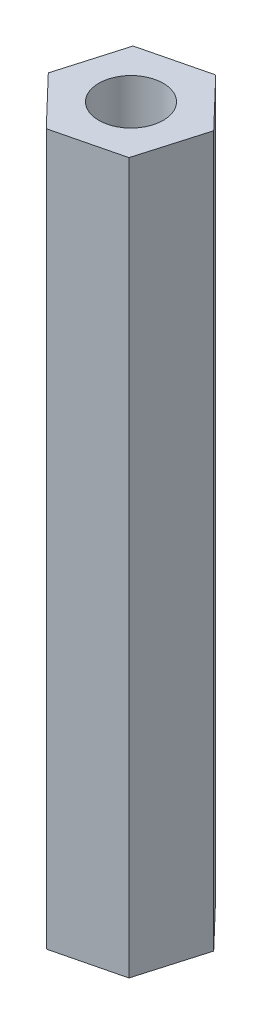
ISO-10303-21;
HEADER;
FILE_DESCRIPTION(('STEP AP214'),'2;1');
FILE_NAME('part.step','',(''),(''),'','','');
FILE_SCHEMA(('AUTOMOTIVE_DESIGN { 1 0 10303 214 1 1 1 1 }'));
ENDSEC;
DATA;
#1=APPLICATION_CONTEXT('core data for automotive mechanical design processes');
#2=APPLICATION_PROTOCOL_DEFINITION('international standard','automotive_design',2000,#1);
#3=PRODUCT_CONTEXT('',#1,'mechanical');
#4=PRODUCT('Part','Part','',(#3));
#5=PRODUCT_RELATED_PRODUCT_CATEGORY('part','',(#4));
#6=PRODUCT_DEFINITION_FORMATION('','',#4);
#7=PRODUCT_DEFINITION_CONTEXT('part definition',#1,'design');
#8=PRODUCT_DEFINITION('design','',#6,#7);
#9=PRODUCT_DEFINITION_SHAPE('','',#8);
#10=(LENGTH_UNIT() NAMED_UNIT(*) SI_UNIT(.MILLI.,.METRE.));
#11=(NAMED_UNIT(*) PLANE_ANGLE_UNIT() SI_UNIT($,.RADIAN.));
#12=(NAMED_UNIT(*) SI_UNIT($,.STERADIAN.) SOLID_ANGLE_UNIT());
#13=UNCERTAINTY_MEASURE_WITH_UNIT(LENGTH_MEASURE(1.E-05),#10,'distance_accuracy_value','');
#14=(GEOMETRIC_REPRESENTATION_CONTEXT(3) GLOBAL_UNCERTAINTY_ASSIGNED_CONTEXT((#13)) GLOBAL_UNIT_ASSIGNED_CONTEXT((#10,
#11,#12)) REPRESENTATION_CONTEXT('',''));
#15=CARTESIAN_POINT('',(0.,0.,0.));
#16=DIRECTION('',(0.,0.,1.));
#17=DIRECTION('',(1.,0.,0.));
#18=AXIS2_PLACEMENT_3D('',#15,#16,#17);
#19=CARTESIAN_POINT('',(-6.32811130994487,38.1,-2.46052037020981));
#20=DIRECTION('',(-0.238502387947703,0.,-0.971141910815944));
#21=DIRECTION('',(-0.971141910815944,0.,0.238502387947703));
#22=AXIS2_PLACEMENT_3D('',#19,#20,#21);
#23=PLANE('',#22);
#24=DIRECTION('',(0.971141910815944,0.,-0.238502387947703));
#25=VECTOR('',#24,1.);
#26=CARTESIAN_POINT('',(-6.32811130994487,0.,-2.46052037020981));
#27=LINE('',#26,#25);
#28=CARTESIAN_POINT('',(-6.32811130994487,0.,-2.46052037020981));
#29=VERTEX_POINT('',#28);
#30=CARTESIAN_POINT('',(-2.76773588288857,0.,-3.33491167377304));
#31=VERTEX_POINT('',#30);
#32=EDGE_CURVE('E121',#29,#31,#27,.T.);
#33=ORIENTED_EDGE('',*,*,#32,.T.);
#34=DIRECTION('',(0.,-1.,0.));
#35=VECTOR('',#34,1.);
#36=CARTESIAN_POINT('',(-2.76773588288857,38.1,-3.33491167377304));
#37=LINE('',#36,#35);
#38=CARTESIAN_POINT('',(-2.76773588288857,38.1,-3.33491167377304));
#39=VERTEX_POINT('',#38);
#40=EDGE_CURVE('E11',#39,#31,#37,.T.);
#41=ORIENTED_EDGE('',*,*,#40,.F.);
#42=DIRECTION('',(0.971141910815944,0.,-0.238502387947703));
#43=VECTOR('',#42,1.);
#44=CARTESIAN_POINT('',(-6.32811130994487,38.1,-2.46052037020981));
#45=LINE('',#44,#43);
#46=CARTESIAN_POINT('',(-6.32811130994487,38.1,-2.46052037020981));
#47=VERTEX_POINT('',#46);
#48=EDGE_CURVE('E132',#47,#39,#45,.T.);
#49=ORIENTED_EDGE('',*,*,#48,.F.);
#50=DIRECTION('',(0.,-1.,0.));
#51=VECTOR('',#50,1.);
#52=CARTESIAN_POINT('',(-6.32811130994487,38.1,-2.46052037020981));
#53=LINE('',#52,#51);
#54=EDGE_CURVE('E117',#47,#29,#53,.T.);
#55=ORIENTED_EDGE('',*,*,#54,.T.);
#56=EDGE_LOOP('',(#33,#41,#49,#55));
#57=FACE_BOUND('',#56,.T.);
#58=ADVANCED_FACE('F37',(#57),#23,.F.);
#59=CARTESIAN_POINT('',(-2.76773588288857,38.1,-3.33491167377304));
#60=DIRECTION('',(-0.960284759420221,0.,-0.279021828582011));
#61=DIRECTION('',(-0.279021828582011,0.,0.960284759420221));
#62=AXIS2_PLACEMENT_3D('',#59,#60,#61);
#63=PLANE('',#62);
#64=DIRECTION('',(0.279021828582011,0.,-0.960284759420221));
#65=VECTOR('',#64,1.);
#66=CARTESIAN_POINT('',(-2.76773588288857,0.,-3.33491167377304));
#67=LINE('',#66,#65);
#68=CARTESIAN_POINT('',(-1.74479325109438,0.,-6.85548289239529));
#69=VERTEX_POINT('',#68);
#70=EDGE_CURVE('E124',#31,#69,#67,.T.);
#71=ORIENTED_EDGE('',*,*,#70,.T.);
#72=DIRECTION('',(0.,-1.,0.));
#73=VECTOR('',#72,1.);
#74=CARTESIAN_POINT('',(-1.74479325109438,38.1,-6.85548289239529));
#75=LINE('',#74,#73);
#76=CARTESIAN_POINT('',(-1.74479325109438,38.1,-6.85548289239529));
#77=VERTEX_POINT('',#76);
#78=EDGE_CURVE('E45',#77,#69,#75,.T.);
#79=ORIENTED_EDGE('',*,*,#78,.F.);
#80=DIRECTION('',(0.279021828582011,0.,-0.960284759420221));
#81=VECTOR('',#80,1.);
#82=CARTESIAN_POINT('',(-2.76773588288857,38.1,-3.33491167377304));
#83=LINE('',#82,#81);
#84=EDGE_CURVE('E90',#39,#77,#83,.T.);
#85=ORIENTED_EDGE('',*,*,#84,.F.);
#86=ORIENTED_EDGE('',*,*,#40,.T.);
#87=EDGE_LOOP('',(#71,#79,#85,#86));
#88=FACE_BOUND('',#87,.T.);
#89=ADVANCED_FACE('F157',(#88),#63,.F.);
#90=CARTESIAN_POINT('',(-1.74479325109438,38.1,-6.85548289239529));
#91=DIRECTION('',(-0.721782371472518,0.,0.692120082233934));
#92=DIRECTION('',(0.692120082233934,0.,0.721782371472518));
#93=AXIS2_PLACEMENT_3D('',#90,#91,#92);
#94=PLANE('',#93);
#95=DIRECTION('',(-0.692120082233934,0.,-0.721782371472518));
#96=VECTOR('',#95,1.);
#97=CARTESIAN_POINT('',(-1.74479325109438,0.,-6.85548289239529));
#98=LINE('',#97,#96);
#99=CARTESIAN_POINT('',(-4.28222604635648,0.,-9.50166280745429));
#100=VERTEX_POINT('',#99);
#101=EDGE_CURVE('E127',#69,#100,#98,.T.);
#102=ORIENTED_EDGE('',*,*,#101,.T.);
#103=DIRECTION('',(0.,-1.,0.));
#104=VECTOR('',#103,1.);
#105=CARTESIAN_POINT('',(-4.28222604635648,38.1,-9.50166280745429));
#106=LINE('',#105,#104);
#107=CARTESIAN_POINT('',(-4.28222604635648,38.1,-9.50166280745429));
#108=VERTEX_POINT('',#107);
#109=EDGE_CURVE('E112',#108,#100,#106,.T.);
#110=ORIENTED_EDGE('',*,*,#109,.F.);
#111=DIRECTION('',(-0.692120082233934,0.,-0.721782371472518));
#112=VECTOR('',#111,1.);
#113=CARTESIAN_POINT('',(-1.74479325109438,38.1,-6.85548289239529));
#114=LINE('',#113,#112);
#115=EDGE_CURVE('E103',#77,#108,#114,.T.);
#116=ORIENTED_EDGE('',*,*,#115,.F.);
#117=ORIENTED_EDGE('',*,*,#78,.T.);
#118=EDGE_LOOP('',(#102,#110,#116,#117));
#119=FACE_BOUND('',#118,.T.);
#120=ADVANCED_FACE('F138',(#119),#94,.F.);
#121=CARTESIAN_POINT('',(-4.28222604635648,38.1,-9.50166280745429));
#122=DIRECTION('',(0.238502387947701,0.,0.971141910815945));
#123=DIRECTION('',(0.971141910815945,0.,-0.238502387947701));
#124=AXIS2_PLACEMENT_3D('',#121,#122,#123);
#125=PLANE('',#124);
#126=DIRECTION('',(-0.971141910815945,0.,0.238502387947701));
#127=VECTOR('',#126,1.);
#128=CARTESIAN_POINT('',(-4.28222604635648,0.,-9.50166280745429));
#129=LINE('',#128,#127);
#130=CARTESIAN_POINT('',(-7.84260147341278,0.,-8.62727150389105));
#131=VERTEX_POINT('',#130);
#132=EDGE_CURVE('E111',#100,#131,#129,.T.);
#133=ORIENTED_EDGE('',*,*,#132,.T.);
#134=DIRECTION('',(0.,-1.,0.));
#135=VECTOR('',#134,1.);
#136=CARTESIAN_POINT('',(-7.84260147341278,38.1,-8.62727150389105));
#137=LINE('',#136,#135);
#138=CARTESIAN_POINT('',(-7.84260147341278,38.1,-8.62727150389105));
#139=VERTEX_POINT('',#138);
#140=EDGE_CURVE('E108',#139,#131,#137,.T.);
#141=ORIENTED_EDGE('',*,*,#140,.F.);
#142=DIRECTION('',(-0.971141910815945,0.,0.238502387947701));
#143=VECTOR('',#142,1.);
#144=CARTESIAN_POINT('',(-4.28222604635648,38.1,-9.50166280745429));
#145=LINE('',#144,#143);
#146=EDGE_CURVE('E97',#108,#139,#145,.T.);
#147=ORIENTED_EDGE('',*,*,#146,.F.);
#148=ORIENTED_EDGE('',*,*,#109,.T.);
#149=EDGE_LOOP('',(#133,#141,#147,#148));
#150=FACE_BOUND('',#149,.T.);
#151=ADVANCED_FACE('F109',(#150),#125,.F.);
#152=CARTESIAN_POINT('',(-7.84260147341278,38.1,-8.62727150389105));
#153=DIRECTION('',(0.960284759420221,0.,0.27902182858201));
#154=DIRECTION('',(0.27902182858201,0.,-0.960284759420221));
#155=AXIS2_PLACEMENT_3D('',#152,#153,#154);
#156=PLANE('',#155);
#157=DIRECTION('',(-0.27902182858201,0.,0.960284759420221));
#158=VECTOR('',#157,1.);
#159=CARTESIAN_POINT('',(-7.84260147341278,0.,-8.62727150389105));
#160=LINE('',#159,#158);
#161=CARTESIAN_POINT('',(-8.86554410520697,0.,-5.10670028526881));
#162=VERTEX_POINT('',#161);
#163=EDGE_CURVE('E76',#131,#162,#160,.T.);
#164=ORIENTED_EDGE('',*,*,#163,.T.);
#165=DIRECTION('',(0.,-1.,0.));
#166=VECTOR('',#165,1.);
#167=CARTESIAN_POINT('',(-8.86554410520697,38.1,-5.10670028526881));
#168=LINE('',#167,#166);
#169=CARTESIAN_POINT('',(-8.86554410520697,38.1,-5.10670028526881));
#170=VERTEX_POINT('',#169);
#171=EDGE_CURVE('E113',#170,#162,#168,.T.);
#172=ORIENTED_EDGE('',*,*,#171,.F.);
#173=DIRECTION('',(-0.27902182858201,0.,0.960284759420221));
#174=VECTOR('',#173,1.);
#175=CARTESIAN_POINT('',(-7.84260147341278,38.1,-8.62727150389105));
#176=LINE('',#175,#174);
#177=EDGE_CURVE('E101',#139,#170,#176,.T.);
#178=ORIENTED_EDGE('',*,*,#177,.F.);
#179=ORIENTED_EDGE('',*,*,#140,.T.);
#180=EDGE_LOOP('',(#164,#172,#178,#179));
#181=FACE_BOUND('',#180,.T.);
#182=ADVANCED_FACE('F115',(#181),#156,.F.);
#183=CARTESIAN_POINT('',(-8.86554410520697,38.1,-5.10670028526881));
#184=DIRECTION('',(0.721782371472518,0.,-0.692120082233934));
#185=DIRECTION('',(-0.692120082233934,0.,-0.721782371472518));
#186=AXIS2_PLACEMENT_3D('',#183,#184,#185);
#187=PLANE('',#186);
#188=DIRECTION('',(0.692120082233934,0.,0.721782371472518));
#189=VECTOR('',#188,1.);
#190=CARTESIAN_POINT('',(-8.86554410520697,0.,-5.10670028526881));
#191=LINE('',#190,#189);
#192=EDGE_CURVE('E82',#162,#29,#191,.T.);
#193=ORIENTED_EDGE('',*,*,#192,.T.);
#194=ORIENTED_EDGE('',*,*,#54,.F.);
#195=DIRECTION('',(0.692120082233934,0.,0.721782371472518));
#196=VECTOR('',#195,1.);
#197=CARTESIAN_POINT('',(-8.86554410520697,38.1,-5.10670028526881));
#198=LINE('',#197,#196);
#199=EDGE_CURVE('E53',#170,#47,#198,.T.);
#200=ORIENTED_EDGE('',*,*,#199,.F.);
#201=ORIENTED_EDGE('',*,*,#171,.T.);
#202=EDGE_LOOP('',(#193,#194,#200,#201));
#203=FACE_BOUND('',#202,.T.);
#204=ADVANCED_FACE('F145',(#203),#187,.F.);
#205=CARTESIAN_POINT('',(0.,38.1,0.));
#206=DIRECTION('',(0.,1.,0.));
#207=DIRECTION('',(0.,0.,1.));
#208=AXIS2_PLACEMENT_3D('',#205,#206,#207);
#209=PLANE('',#208);
#210=CARTESIAN_POINT('',(-5.30516867815067,38.1,-5.98109158883205));
#211=DIRECTION('',(0.,1.,0.));
#212=DIRECTION('',(0.,0.,1.));
#213=AXIS2_PLACEMENT_3D('',#210,#211,#212);
#214=CIRCLE('',#213,1.7272);
#215=CARTESIAN_POINT('',(-5.30516867815067,38.1,-4.25389158883205));
#216=VERTEX_POINT('',#215);
#217=EDGE_CURVE('E282',#216,#216,#214,.T.);
#218=ORIENTED_EDGE('',*,*,#217,.F.);
#219=EDGE_LOOP('',(#218));
#220=FACE_BOUND('',#219,.T.);
#221=ORIENTED_EDGE('',*,*,#48,.T.);
#222=ORIENTED_EDGE('',*,*,#84,.T.);
#223=ORIENTED_EDGE('',*,*,#115,.T.);
#224=ORIENTED_EDGE('',*,*,#146,.T.);
#225=ORIENTED_EDGE('',*,*,#177,.T.);
#226=ORIENTED_EDGE('',*,*,#199,.T.);
#227=EDGE_LOOP('',(#221,#222,#223,#224,#225,#226));
#228=FACE_BOUND('',#227,.T.);
#229=ADVANCED_FACE('F99',(#220,#228),#209,.T.);
#230=CARTESIAN_POINT('',(0.,0.,0.));
#231=DIRECTION('',(0.,1.,0.));
#232=DIRECTION('',(0.,0.,1.));
#233=AXIS2_PLACEMENT_3D('',#230,#231,#232);
#234=PLANE('',#233);
#235=CARTESIAN_POINT('',(-5.30516867815067,0.,-5.98109158883205));
#236=DIRECTION('',(0.,-1.,0.));
#237=DIRECTION('',(0.,0.,-1.));
#238=AXIS2_PLACEMENT_3D('',#235,#236,#237);
#239=CIRCLE('',#238,1.7272);
#240=CARTESIAN_POINT('',(-5.30516867815067,0.,-7.70829158883205));
#241=VERTEX_POINT('',#240);
#242=EDGE_CURVE('E277',#241,#241,#239,.T.);
#243=ORIENTED_EDGE('',*,*,#242,.F.);
#244=EDGE_LOOP('',(#243));
#245=FACE_BOUND('',#244,.T.);
#246=ORIENTED_EDGE('',*,*,#32,.F.);
#247=ORIENTED_EDGE('',*,*,#192,.F.);
#248=ORIENTED_EDGE('',*,*,#163,.F.);
#249=ORIENTED_EDGE('',*,*,#132,.F.);
#250=ORIENTED_EDGE('',*,*,#101,.F.);
#251=ORIENTED_EDGE('',*,*,#70,.F.);
#252=EDGE_LOOP('',(#246,#247,#248,#249,#250,#251));
#253=FACE_BOUND('',#252,.T.);
#254=ADVANCED_FACE('F141',(#245,#253),#234,.F.);
#255=CARTESIAN_POINT('',(-5.30516867815067,28.575,-5.98109158883205));
#256=DIRECTION('',(0.,1.,0.));
#257=DIRECTION('',(0.,0.,1.));
#258=AXIS2_PLACEMENT_3D('',#255,#256,#257);
#259=CYLINDRICAL_SURFACE('',#258,1.7272);
#260=CARTESIAN_POINT('',(-5.30516867815067,28.575,-5.98109158883205));
#261=DIRECTION('',(0.,1.,0.));
#262=DIRECTION('',(0.,0.,1.));
#263=AXIS2_PLACEMENT_3D('',#260,#261,#262);
#264=CIRCLE('',#263,1.7272);
#265=CARTESIAN_POINT('',(-5.30516867815067,28.575,-4.25389158883205));
#266=VERTEX_POINT('',#265);
#267=EDGE_CURVE('E125',#266,#266,#264,.T.);
#268=ORIENTED_EDGE('',*,*,#267,.F.);
#269=EDGE_LOOP('',(#268));
#270=FACE_BOUND('',#269,.T.);
#271=ORIENTED_EDGE('',*,*,#217,.T.);
#272=EDGE_LOOP('',(#271));
#273=FACE_BOUND('',#272,.T.);
#274=ADVANCED_FACE('F185',(#270,#273),#259,.F.);
#275=CARTESIAN_POINT('',(-5.30516867815067,28.575,-5.98109158883205));
#276=DIRECTION('',(0.,1.,0.));
#277=DIRECTION('',(0.,0.,1.));
#278=AXIS2_PLACEMENT_3D('',#275,#276,#277);
#279=PLANE('',#278);
#280=ORIENTED_EDGE('',*,*,#267,.T.);
#281=EDGE_LOOP('',(#280));
#282=FACE_BOUND('',#281,.T.);
#283=ADVANCED_FACE('F190',(#282),#279,.T.);
#284=CARTESIAN_POINT('',(-5.30516867815067,9.525,-5.98109158883205));
#285=DIRECTION('',(0.,-1.,0.));
#286=DIRECTION('',(0.,0.,-1.));
#287=AXIS2_PLACEMENT_3D('',#284,#285,#286);
#288=CYLINDRICAL_SURFACE('',#287,1.7272);
#289=CARTESIAN_POINT('',(-5.30516867815067,9.525,-5.98109158883205));
#290=DIRECTION('',(0.,-1.,0.));
#291=DIRECTION('',(0.,0.,-1.));
#292=AXIS2_PLACEMENT_3D('',#289,#290,#291);
#293=CIRCLE('',#292,1.7272);
#294=CARTESIAN_POINT('',(-5.30516867815067,9.525,-7.70829158883205));
#295=VERTEX_POINT('',#294);
#296=EDGE_CURVE('E279',#295,#295,#293,.T.);
#297=ORIENTED_EDGE('',*,*,#296,.F.);
#298=EDGE_LOOP('',(#297));
#299=FACE_BOUND('',#298,.T.);
#300=ORIENTED_EDGE('',*,*,#242,.T.);
#301=EDGE_LOOP('',(#300));
#302=FACE_BOUND('',#301,.T.);
#303=ADVANCED_FACE('F201',(#299,#302),#288,.F.);
#304=CARTESIAN_POINT('',(-5.30516867815067,9.525,-5.98109158883205));
#305=DIRECTION('',(0.,-1.,0.));
#306=DIRECTION('',(0.,0.,-1.));
#307=AXIS2_PLACEMENT_3D('',#304,#305,#306);
#308=PLANE('',#307);
#309=ORIENTED_EDGE('',*,*,#296,.T.);
#310=EDGE_LOOP('',(#309));
#311=FACE_BOUND('',#310,.T.);
#312=ADVANCED_FACE('F217',(#311),#308,.T.);
#313=CLOSED_SHELL('',(#58,#89,#120,#151,#182,#204,#229,#254,#274,#283,#303,#312));
#314=MANIFOLD_SOLID_BREP('B2',#313);
#315=ADVANCED_BREP_SHAPE_REPRESENTATION('',(#18,#314),#14);
#316=SHAPE_DEFINITION_REPRESENTATION(#9,#315);
ENDSEC;
END-ISO-10303-21;
